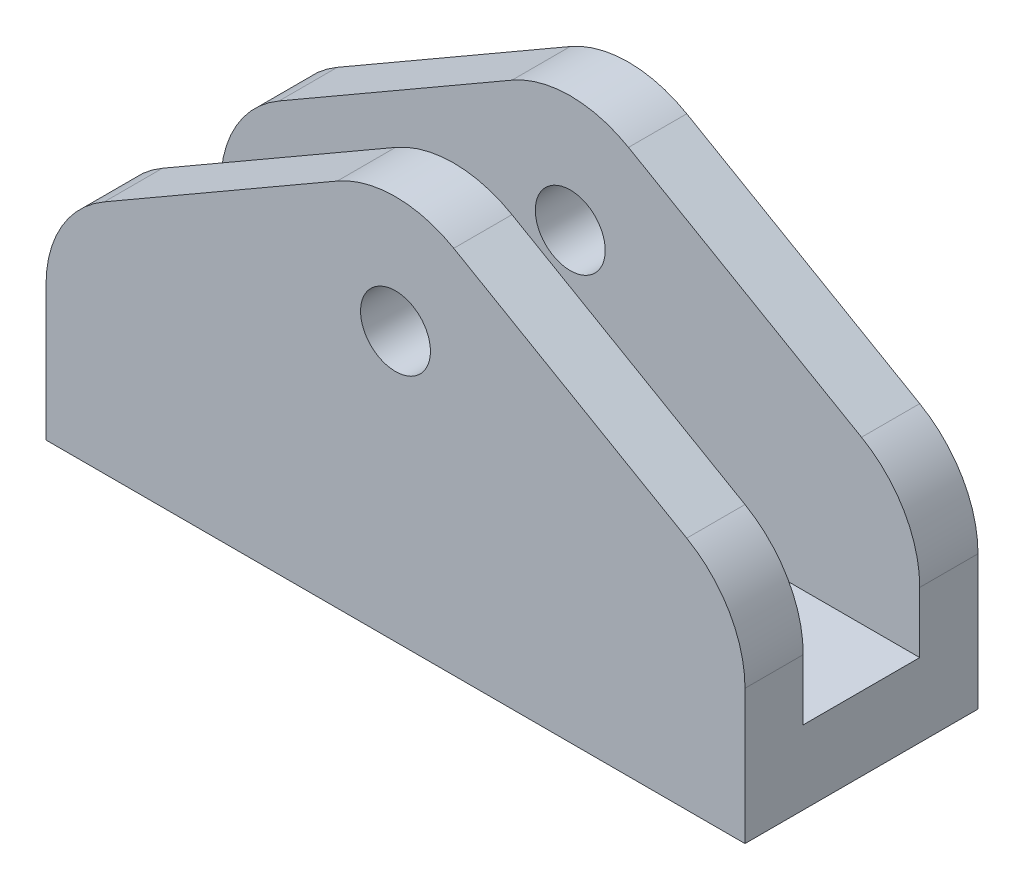
ISO-10303-21;
HEADER;
FILE_DESCRIPTION(('STEP AP214'),'2;1');
FILE_NAME('part.step','',(''),(''),'','','');
FILE_SCHEMA(('AUTOMOTIVE_DESIGN { 1 0 10303 214 1 1 1 1 }'));
ENDSEC;
DATA;
#1=APPLICATION_CONTEXT('core data for automotive mechanical design processes');
#2=APPLICATION_PROTOCOL_DEFINITION('international standard','automotive_design',2000,#1);
#3=PRODUCT_CONTEXT('',#1,'mechanical');
#4=PRODUCT('Part','Part','',(#3));
#5=PRODUCT_RELATED_PRODUCT_CATEGORY('part','',(#4));
#6=PRODUCT_DEFINITION_FORMATION('','',#4);
#7=PRODUCT_DEFINITION_CONTEXT('part definition',#1,'design');
#8=PRODUCT_DEFINITION('design','',#6,#7);
#9=PRODUCT_DEFINITION_SHAPE('','',#8);
#10=(LENGTH_UNIT() NAMED_UNIT(*) SI_UNIT(.MILLI.,.METRE.));
#11=(NAMED_UNIT(*) PLANE_ANGLE_UNIT() SI_UNIT($,.RADIAN.));
#12=(NAMED_UNIT(*) SI_UNIT($,.STERADIAN.) SOLID_ANGLE_UNIT());
#13=UNCERTAINTY_MEASURE_WITH_UNIT(LENGTH_MEASURE(1.E-05),#10,'distance_accuracy_value','');
#14=(GEOMETRIC_REPRESENTATION_CONTEXT(3) GLOBAL_UNCERTAINTY_ASSIGNED_CONTEXT((#13)) GLOBAL_UNIT_ASSIGNED_CONTEXT((#10,
#11,#12)) REPRESENTATION_CONTEXT('',''));
#15=CARTESIAN_POINT('',(0.,0.,0.));
#16=DIRECTION('',(0.,0.,1.));
#17=DIRECTION('',(1.,0.,0.));
#18=AXIS2_PLACEMENT_3D('',#15,#16,#17);
#19=CARTESIAN_POINT('',(14.9999999999999,8.66025403784441,5.));
#20=DIRECTION('',(-0.499999999999995,-0.866025403784442,0.));
#21=DIRECTION('',(0.866025403784442,-0.499999999999995,0.));
#22=AXIS2_PLACEMENT_3D('',#19,#20,#21);
#23=PLANE('',#22);
#24=DIRECTION('',(0.,0.,-1.));
#25=VECTOR('',#24,1.);
#26=CARTESIAN_POINT('',(2.49999999999989,15.8771324027146,5.));
#27=LINE('',#26,#25);
#28=CARTESIAN_POINT('',(2.49999999999989,15.8771324027146,-5.));
#29=VERTEX_POINT('',#28);
#30=CARTESIAN_POINT('',(2.49999999999988,15.8771324027146,-2.5));
#31=VERTEX_POINT('',#30);
#32=EDGE_CURVE('E281',#29,#31,#27,.F.);
#33=ORIENTED_EDGE('',*,*,#32,.T.);
#34=DIRECTION('',(0.866025403784442,-0.499999999999995,0.));
#35=VECTOR('',#34,1.);
#36=CARTESIAN_POINT('',(14.9999999999999,8.66025403784441,-2.5));
#37=LINE('',#36,#35);
#38=CARTESIAN_POINT('',(12.4999999999999,10.1036297108185,-2.5));
#39=VERTEX_POINT('',#38);
#40=EDGE_CURVE('E221',#31,#39,#37,.T.);
#41=ORIENTED_EDGE('',*,*,#40,.T.);
#42=DIRECTION('',(0.,0.,-1.));
#43=VECTOR('',#42,1.);
#44=CARTESIAN_POINT('',(12.4999999999999,10.1036297108185,5.));
#45=LINE('',#44,#43);
#46=CARTESIAN_POINT('',(12.4999999999999,10.1036297108185,-5.));
#47=VERTEX_POINT('',#46);
#48=EDGE_CURVE('E285',#39,#47,#45,.T.);
#49=ORIENTED_EDGE('',*,*,#48,.T.);
#50=DIRECTION('',(-0.866025403784442,0.499999999999995,0.));
#51=VECTOR('',#50,1.);
#52=CARTESIAN_POINT('',(14.9999999999999,8.66025403784441,-5.));
#53=LINE('',#52,#51);
#54=EDGE_CURVE('E271',#47,#29,#53,.T.);
#55=ORIENTED_EDGE('',*,*,#54,.T.);
#56=EDGE_LOOP('',(#33,#41,#49,#55));
#57=FACE_BOUND('',#56,.T.);
#58=ADVANCED_FACE('F39',(#57),#23,.F.);
#59=CARTESIAN_POINT('',(-1.20948461451098E-13,17.3205080756887,5.));
#60=DIRECTION('',(0.500000000000007,-0.866025403784435,0.));
#61=DIRECTION('',(0.866025403784435,0.500000000000007,0.));
#62=AXIS2_PLACEMENT_3D('',#59,#60,#61);
#63=PLANE('',#62);
#64=DIRECTION('',(0.,0.,-1.));
#65=VECTOR('',#64,1.);
#66=CARTESIAN_POINT('',(-12.5,10.1036297108183,5.));
#67=LINE('',#66,#65);
#68=CARTESIAN_POINT('',(-12.5,10.1036297108183,-5.));
#69=VERTEX_POINT('',#68);
#70=CARTESIAN_POINT('',(-12.5,10.1036297108183,-2.5));
#71=VERTEX_POINT('',#70);
#72=EDGE_CURVE('E312',#69,#71,#67,.F.);
#73=ORIENTED_EDGE('',*,*,#72,.T.);
#74=DIRECTION('',(0.866025403784435,0.500000000000007,0.));
#75=VECTOR('',#74,1.);
#76=CARTESIAN_POINT('',(-1.20580097079517E-13,17.3205080756887,-2.5));
#77=LINE('',#76,#75);
#78=CARTESIAN_POINT('',(-2.50000000000012,15.8771324027146,-2.5));
#79=VERTEX_POINT('',#78);
#80=EDGE_CURVE('E214',#71,#79,#77,.T.);
#81=ORIENTED_EDGE('',*,*,#80,.T.);
#82=DIRECTION('',(0.,0.,-1.));
#83=VECTOR('',#82,1.);
#84=CARTESIAN_POINT('',(-2.50000000000012,15.8771324027146,5.));
#85=LINE('',#84,#83);
#86=CARTESIAN_POINT('',(-2.50000000000012,15.8771324027146,-5.));
#87=VERTEX_POINT('',#86);
#88=EDGE_CURVE('E316',#79,#87,#85,.T.);
#89=ORIENTED_EDGE('',*,*,#88,.T.);
#90=DIRECTION('',(-0.866025403784435,-0.500000000000007,0.));
#91=VECTOR('',#90,1.);
#92=CARTESIAN_POINT('',(-1.20948461451098E-13,17.3205080756887,-5.));
#93=LINE('',#92,#91);
#94=EDGE_CURVE('E275',#87,#69,#93,.T.);
#95=ORIENTED_EDGE('',*,*,#94,.T.);
#96=EDGE_LOOP('',(#73,#81,#89,#95));
#97=FACE_BOUND('',#96,.T.);
#98=ADVANCED_FACE('F337',(#97),#63,.F.);
#99=CARTESIAN_POINT('',(9.9999999999999,5.77350269189626,5.));
#100=DIRECTION('',(0.,0.,-1.));
#101=DIRECTION('',(-1.,0.,0.));
#102=AXIS2_PLACEMENT_3D('',#99,#100,#101);
#103=CYLINDRICAL_SURFACE('',#102,5.);
#104=CARTESIAN_POINT('',(9.9999999999999,5.77350269189626,-2.5));
#105=DIRECTION('',(0.,0.,-1.));
#106=DIRECTION('',(0.,1.,0.));
#107=AXIS2_PLACEMENT_3D('',#104,#105,#106);
#108=CIRCLE('',#107,5.);
#109=CARTESIAN_POINT('',(14.9999999999999,5.77350269189626,-2.5));
#110=VERTEX_POINT('',#109);
#111=EDGE_CURVE('E225',#110,#39,#108,.F.);
#112=ORIENTED_EDGE('',*,*,#111,.F.);
#113=DIRECTION('',(0.,0.,-1.));
#114=VECTOR('',#113,1.);
#115=CARTESIAN_POINT('',(14.9999999999999,5.77350269189627,5.));
#116=LINE('',#115,#114);
#117=CARTESIAN_POINT('',(14.9999999999999,5.77350269189627,-5.));
#118=VERTEX_POINT('',#117);
#119=EDGE_CURVE('E300',#118,#110,#116,.F.);
#120=ORIENTED_EDGE('',*,*,#119,.F.);
#121=CARTESIAN_POINT('',(9.9999999999999,5.77350269189626,-5.));
#122=DIRECTION('',(0.,0.,1.));
#123=DIRECTION('',(1.,0.,0.));
#124=AXIS2_PLACEMENT_3D('',#121,#122,#123);
#125=CIRCLE('',#124,5.);
#126=EDGE_CURVE('E296',#47,#118,#125,.F.);
#127=ORIENTED_EDGE('',*,*,#126,.F.);
#128=ORIENTED_EDGE('',*,*,#48,.F.);
#129=EDGE_LOOP('',(#112,#120,#127,#128));
#130=FACE_BOUND('',#129,.T.);
#131=ADVANCED_FACE('F344',(#130),#103,.T.);
#132=CARTESIAN_POINT('',(0.,11.5470053837924,5.));
#133=DIRECTION('',(0.,0.,-1.));
#134=DIRECTION('',(-1.,0.,0.));
#135=AXIS2_PLACEMENT_3D('',#132,#133,#134);
#136=CYLINDRICAL_SURFACE('',#135,5.);
#137=CARTESIAN_POINT('',(0.,11.5470053837924,-2.5));
#138=DIRECTION('',(0.,0.,-1.));
#139=DIRECTION('',(0.,1.,0.));
#140=AXIS2_PLACEMENT_3D('',#137,#138,#139);
#141=CIRCLE('',#140,5.);
#142=EDGE_CURVE('E218',#31,#79,#141,.F.);
#143=ORIENTED_EDGE('',*,*,#142,.F.);
#144=ORIENTED_EDGE('',*,*,#32,.F.);
#145=CARTESIAN_POINT('',(0.,11.5470053837924,-5.));
#146=DIRECTION('',(0.,0.,1.));
#147=DIRECTION('',(1.,0.,0.));
#148=AXIS2_PLACEMENT_3D('',#145,#146,#147);
#149=CIRCLE('',#148,5.);
#150=EDGE_CURVE('E293',#87,#29,#149,.F.);
#151=ORIENTED_EDGE('',*,*,#150,.F.);
#152=ORIENTED_EDGE('',*,*,#88,.F.);
#153=EDGE_LOOP('',(#143,#144,#151,#152));
#154=FACE_BOUND('',#153,.T.);
#155=ADVANCED_FACE('F394',(#154),#136,.T.);
#156=CARTESIAN_POINT('',(-9.99999999999997,5.77350269189612,5.));
#157=DIRECTION('',(0.,0.,-1.));
#158=DIRECTION('',(-1.,0.,0.));
#159=AXIS2_PLACEMENT_3D('',#156,#157,#158);
#160=CYLINDRICAL_SURFACE('',#159,5.);
#161=CARTESIAN_POINT('',(-9.99999999999997,5.77350269189612,-2.5));
#162=DIRECTION('',(0.,0.,-1.));
#163=DIRECTION('',(0.,1.,0.));
#164=AXIS2_PLACEMENT_3D('',#161,#162,#163);
#165=CIRCLE('',#164,5.);
#166=CARTESIAN_POINT('',(-15.,5.77350269189613,-2.5));
#167=VERTEX_POINT('',#166);
#168=EDGE_CURVE('E211',#71,#167,#165,.F.);
#169=ORIENTED_EDGE('',*,*,#168,.F.);
#170=ORIENTED_EDGE('',*,*,#72,.F.);
#171=CARTESIAN_POINT('',(-9.99999999999997,5.77350269189612,-5.));
#172=DIRECTION('',(0.,0.,1.));
#173=DIRECTION('',(1.,0.,0.));
#174=AXIS2_PLACEMENT_3D('',#171,#172,#173);
#175=CIRCLE('',#174,5.);
#176=CARTESIAN_POINT('',(-15.,5.77350269189607,-5.));
#177=VERTEX_POINT('',#176);
#178=EDGE_CURVE('E290',#177,#69,#175,.F.);
#179=ORIENTED_EDGE('',*,*,#178,.F.);
#180=DIRECTION('',(0.,0.,-1.));
#181=VECTOR('',#180,1.);
#182=CARTESIAN_POINT('',(-15.,5.77350269189607,5.));
#183=LINE('',#182,#181);
#184=EDGE_CURVE('E49',#167,#177,#183,.T.);
#185=ORIENTED_EDGE('',*,*,#184,.F.);
#186=EDGE_LOOP('',(#169,#170,#179,#185));
#187=FACE_BOUND('',#186,.T.);
#188=ADVANCED_FACE('F375',(#187),#160,.T.);
#189=CARTESIAN_POINT('',(0.,11.5470053837924,-5.));
#190=DIRECTION('',(0.,0.,1.));
#191=DIRECTION('',(1.,0.,0.));
#192=AXIS2_PLACEMENT_3D('',#189,#190,#191);
#193=CYLINDRICAL_SURFACE('',#192,1.5);
#194=CARTESIAN_POINT('',(0.,11.5470053837924,-2.5));
#195=DIRECTION('',(0.,0.,-1.));
#196=DIRECTION('',(0.,1.,0.));
#197=AXIS2_PLACEMENT_3D('',#194,#195,#196);
#198=CIRCLE('',#197,1.5);
#199=CARTESIAN_POINT('',(0.,13.0470053837924,-2.5));
#200=VERTEX_POINT('',#199);
#201=EDGE_CURVE('E43',#200,#200,#198,.F.);
#202=ORIENTED_EDGE('',*,*,#201,.T.);
#203=EDGE_LOOP('',(#202));
#204=FACE_BOUND('',#203,.T.);
#205=CARTESIAN_POINT('',(0.,11.5470053837924,-5.));
#206=DIRECTION('',(0.,0.,1.));
#207=DIRECTION('',(1.,0.,0.));
#208=AXIS2_PLACEMENT_3D('',#205,#206,#207);
#209=CIRCLE('',#208,1.5);
#210=CARTESIAN_POINT('',(1.49999999999992,11.5470053837924,-5.));
#211=VERTEX_POINT('',#210);
#212=EDGE_CURVE('E229',#211,#211,#209,.T.);
#213=ORIENTED_EDGE('',*,*,#212,.F.);
#214=EDGE_LOOP('',(#213));
#215=FACE_BOUND('',#214,.T.);
#216=ADVANCED_FACE('F357',(#204,#215),#193,.F.);
#217=CARTESIAN_POINT('',(14.9999999999999,-8.66025403784431,5.));
#218=DIRECTION('',(-1.,0.,0.));
#219=DIRECTION('',(0.,-1.,0.));
#220=AXIS2_PLACEMENT_3D('',#217,#218,#219);
#221=PLANE('',#220);
#222=ORIENTED_EDGE('',*,*,#119,.T.);
#223=DIRECTION('',(0.,1.,0.));
#224=VECTOR('',#223,1.);
#225=CARTESIAN_POINT('',(14.9999999999999,29.9290535877455,-2.5));
#226=LINE('',#225,#224);
#227=CARTESIAN_POINT('',(14.9999999999999,3.16495717983936,-2.5));
#228=VERTEX_POINT('',#227);
#229=EDGE_CURVE('E167',#228,#110,#226,.T.);
#230=ORIENTED_EDGE('',*,*,#229,.F.);
#231=DIRECTION('',(0.,0.,-1.));
#232=VECTOR('',#231,1.);
#233=CARTESIAN_POINT('',(14.9999999999999,3.16495717983936,2.5));
#234=LINE('',#233,#232);
#235=CARTESIAN_POINT('',(14.9999999999999,3.16495717983936,2.5));
#236=VERTEX_POINT('',#235);
#237=EDGE_CURVE('E166',#236,#228,#234,.T.);
#238=ORIENTED_EDGE('',*,*,#237,.F.);
#239=DIRECTION('',(0.,-1.,0.));
#240=VECTOR('',#239,1.);
#241=CARTESIAN_POINT('',(14.9999999999999,29.9290535877455,2.5));
#242=LINE('',#241,#240);
#243=CARTESIAN_POINT('',(14.9999999999999,5.77350269189626,2.5));
#244=VERTEX_POINT('',#243);
#245=EDGE_CURVE('E154',#244,#236,#242,.T.);
#246=ORIENTED_EDGE('',*,*,#245,.F.);
#247=CARTESIAN_POINT('',(14.9999999999999,5.77350269189627,5.));
#248=VERTEX_POINT('',#247);
#249=EDGE_CURVE('E299',#244,#248,#116,.F.);
#250=ORIENTED_EDGE('',*,*,#249,.T.);
#251=DIRECTION('',(0.,1.,0.));
#252=VECTOR('',#251,1.);
#253=CARTESIAN_POINT('',(14.9999999999999,-8.66025403784431,5.));
#254=LINE('',#253,#252);
#255=CARTESIAN_POINT('',(14.9999999999999,0.,5.));
#256=VERTEX_POINT('',#255);
#257=EDGE_CURVE('E252',#256,#248,#254,.T.);
#258=ORIENTED_EDGE('',*,*,#257,.F.);
#259=DIRECTION('',(0.,0.,1.));
#260=VECTOR('',#259,1.);
#261=CARTESIAN_POINT('',(14.9999999999999,0.,-5.));
#262=LINE('',#261,#260);
#263=CARTESIAN_POINT('',(14.9999999999999,0.,-5.));
#264=VERTEX_POINT('',#263);
#265=EDGE_CURVE('E241',#264,#256,#262,.T.);
#266=ORIENTED_EDGE('',*,*,#265,.F.);
#267=DIRECTION('',(0.,1.,0.));
#268=VECTOR('',#267,1.);
#269=CARTESIAN_POINT('',(14.9999999999999,-8.66025403784431,-5.));
#270=LINE('',#269,#268);
#271=EDGE_CURVE('E249',#264,#118,#270,.T.);
#272=ORIENTED_EDGE('',*,*,#271,.T.);
#273=EDGE_LOOP('',(#222,#230,#238,#246,#250,#258,#266,#272));
#274=FACE_BOUND('',#273,.T.);
#275=ADVANCED_FACE('F179',(#274),#221,.F.);
#276=CARTESIAN_POINT('',(12.4999999999999,10.1036297108185,5.));
#277=VERTEX_POINT('',#276);
#278=CARTESIAN_POINT('',(12.4999999999999,10.1036297108185,2.5));
#279=VERTEX_POINT('',#278);
#280=EDGE_CURVE('E286',#277,#279,#45,.T.);
#281=ORIENTED_EDGE('',*,*,#280,.T.);
#282=DIRECTION('',(-0.866025403784442,0.499999999999995,0.));
#283=VECTOR('',#282,1.);
#284=CARTESIAN_POINT('',(14.9999999999999,8.66025403784441,2.5));
#285=LINE('',#284,#283);
#286=CARTESIAN_POINT('',(2.49999999999988,15.8771324027146,2.5));
#287=VERTEX_POINT('',#286);
#288=EDGE_CURVE('E205',#279,#287,#285,.T.);
#289=ORIENTED_EDGE('',*,*,#288,.T.);
#290=CARTESIAN_POINT('',(2.49999999999989,15.8771324027146,5.));
#291=VERTEX_POINT('',#290);
#292=EDGE_CURVE('E267',#287,#291,#27,.F.);
#293=ORIENTED_EDGE('',*,*,#292,.T.);
#294=DIRECTION('',(-0.866025403784442,0.499999999999995,0.));
#295=VECTOR('',#294,1.);
#296=CARTESIAN_POINT('',(14.9999999999999,8.66025403784441,5.));
#297=LINE('',#296,#295);
#298=EDGE_CURVE('E256',#277,#291,#297,.T.);
#299=ORIENTED_EDGE('',*,*,#298,.F.);
#300=EDGE_LOOP('',(#281,#289,#293,#299));
#301=FACE_BOUND('',#300,.T.);
#302=ADVANCED_FACE('F340',(#301),#23,.F.);
#303=CARTESIAN_POINT('',(-2.50000000000012,15.8771324027146,5.));
#304=VERTEX_POINT('',#303);
#305=CARTESIAN_POINT('',(-2.50000000000012,15.8771324027146,2.5));
#306=VERTEX_POINT('',#305);
#307=EDGE_CURVE('E317',#304,#306,#85,.T.);
#308=ORIENTED_EDGE('',*,*,#307,.T.);
#309=DIRECTION('',(-0.866025403784435,-0.500000000000007,0.));
#310=VECTOR('',#309,1.);
#311=CARTESIAN_POINT('',(-1.20825673327238E-13,17.3205080756887,2.5));
#312=LINE('',#311,#310);
#313=CARTESIAN_POINT('',(-12.5,10.1036297108183,2.5));
#314=VERTEX_POINT('',#313);
#315=EDGE_CURVE('E198',#306,#314,#312,.T.);
#316=ORIENTED_EDGE('',*,*,#315,.T.);
#317=CARTESIAN_POINT('',(-12.5,10.1036297108183,5.));
#318=VERTEX_POINT('',#317);
#319=EDGE_CURVE('E311',#314,#318,#67,.F.);
#320=ORIENTED_EDGE('',*,*,#319,.T.);
#321=DIRECTION('',(-0.866025403784435,-0.500000000000007,0.));
#322=VECTOR('',#321,1.);
#323=CARTESIAN_POINT('',(-1.20948461451098E-13,17.3205080756887,5.));
#324=LINE('',#323,#322);
#325=EDGE_CURVE('E261',#304,#318,#324,.T.);
#326=ORIENTED_EDGE('',*,*,#325,.F.);
#327=EDGE_LOOP('',(#308,#316,#320,#326));
#328=FACE_BOUND('',#327,.T.);
#329=ADVANCED_FACE('F347',(#328),#63,.F.);
#330=CARTESIAN_POINT('',(-15.,8.6602540378442,5.));
#331=DIRECTION('',(1.,0.,0.));
#332=DIRECTION('',(0.,1.,0.));
#333=AXIS2_PLACEMENT_3D('',#330,#331,#332);
#334=PLANE('',#333);
#335=DIRECTION('',(0.,0.,-1.));
#336=VECTOR('',#335,1.);
#337=CARTESIAN_POINT('',(-15.,3.16495717983936,2.5));
#338=LINE('',#337,#336);
#339=CARTESIAN_POINT('',(-15.,3.16495717983936,2.5));
#340=VERTEX_POINT('',#339);
#341=CARTESIAN_POINT('',(-15.,3.16495717983936,-2.5));
#342=VERTEX_POINT('',#341);
#343=EDGE_CURVE('E174',#340,#342,#338,.T.);
#344=ORIENTED_EDGE('',*,*,#343,.T.);
#345=DIRECTION('',(0.,1.,0.));
#346=VECTOR('',#345,1.);
#347=CARTESIAN_POINT('',(-15.,29.9290535877455,-2.5));
#348=LINE('',#347,#346);
#349=EDGE_CURVE('E181',#342,#167,#348,.T.);
#350=ORIENTED_EDGE('',*,*,#349,.T.);
#351=ORIENTED_EDGE('',*,*,#184,.T.);
#352=DIRECTION('',(0.,-1.,0.));
#353=VECTOR('',#352,1.);
#354=CARTESIAN_POINT('',(-15.,8.6602540378442,-5.));
#355=LINE('',#354,#353);
#356=CARTESIAN_POINT('',(-14.9999999999999,0.,-5.));
#357=VERTEX_POINT('',#356);
#358=EDGE_CURVE('E257',#177,#357,#355,.T.);
#359=ORIENTED_EDGE('',*,*,#358,.T.);
#360=DIRECTION('',(0.,0.,1.));
#361=VECTOR('',#360,1.);
#362=CARTESIAN_POINT('',(-14.9999999999999,-1.56125112837913E-13,-5.));
#363=LINE('',#362,#361);
#364=CARTESIAN_POINT('',(-14.9999999999999,-1.56125112837913E-13,5.));
#365=VERTEX_POINT('',#364);
#366=EDGE_CURVE('E245',#357,#365,#363,.T.);
#367=ORIENTED_EDGE('',*,*,#366,.T.);
#368=DIRECTION('',(0.,-1.,0.));
#369=VECTOR('',#368,1.);
#370=CARTESIAN_POINT('',(-15.,8.6602540378442,5.));
#371=LINE('',#370,#369);
#372=CARTESIAN_POINT('',(-15.,5.77350269189607,5.));
#373=VERTEX_POINT('',#372);
#374=EDGE_CURVE('E264',#373,#365,#371,.T.);
#375=ORIENTED_EDGE('',*,*,#374,.F.);
#376=CARTESIAN_POINT('',(-15.,5.77350269189607,2.5));
#377=VERTEX_POINT('',#376);
#378=EDGE_CURVE('E11',#373,#377,#183,.T.);
#379=ORIENTED_EDGE('',*,*,#378,.T.);
#380=DIRECTION('',(0.,-1.,0.));
#381=VECTOR('',#380,1.);
#382=CARTESIAN_POINT('',(-15.,29.9290535877455,2.5));
#383=LINE('',#382,#381);
#384=EDGE_CURVE('E57',#377,#340,#383,.T.);
#385=ORIENTED_EDGE('',*,*,#384,.T.);
#386=EDGE_LOOP('',(#344,#350,#351,#359,#367,#375,#379,#385));
#387=FACE_BOUND('',#386,.T.);
#388=ADVANCED_FACE('F355',(#387),#334,.F.);
#389=CARTESIAN_POINT('',(0.,0.,5.));
#390=DIRECTION('',(0.,0.,1.));
#391=DIRECTION('',(1.,0.,0.));
#392=AXIS2_PLACEMENT_3D('',#389,#390,#391);
#393=PLANE('',#392);
#394=CARTESIAN_POINT('',(0.,11.5470053837924,5.));
#395=DIRECTION('',(0.,0.,1.));
#396=DIRECTION('',(1.,0.,0.));
#397=AXIS2_PLACEMENT_3D('',#394,#395,#396);
#398=CIRCLE('',#397,1.5);
#399=CARTESIAN_POINT('',(1.49999999999992,11.5470053837924,5.));
#400=VERTEX_POINT('',#399);
#401=EDGE_CURVE('E228',#400,#400,#398,.T.);
#402=ORIENTED_EDGE('',*,*,#401,.F.);
#403=EDGE_LOOP('',(#402));
#404=FACE_BOUND('',#403,.T.);
#405=ORIENTED_EDGE('',*,*,#257,.T.);
#406=CARTESIAN_POINT('',(9.9999999999999,5.77350269189626,5.));
#407=DIRECTION('',(0.,0.,1.));
#408=DIRECTION('',(1.,0.,0.));
#409=AXIS2_PLACEMENT_3D('',#406,#407,#408);
#410=CIRCLE('',#409,5.);
#411=EDGE_CURVE('E308',#248,#277,#410,.T.);
#412=ORIENTED_EDGE('',*,*,#411,.T.);
#413=ORIENTED_EDGE('',*,*,#298,.T.);
#414=CARTESIAN_POINT('',(0.,11.5470053837924,5.));
#415=DIRECTION('',(0.,0.,1.));
#416=DIRECTION('',(1.,0.,0.));
#417=AXIS2_PLACEMENT_3D('',#414,#415,#416);
#418=CIRCLE('',#417,5.);
#419=EDGE_CURVE('E305',#291,#304,#418,.T.);
#420=ORIENTED_EDGE('',*,*,#419,.T.);
#421=ORIENTED_EDGE('',*,*,#325,.T.);
#422=CARTESIAN_POINT('',(-9.99999999999997,5.77350269189612,5.));
#423=DIRECTION('',(0.,0.,1.));
#424=DIRECTION('',(1.,0.,0.));
#425=AXIS2_PLACEMENT_3D('',#422,#423,#424);
#426=CIRCLE('',#425,5.);
#427=EDGE_CURVE('E65',#318,#373,#426,.T.);
#428=ORIENTED_EDGE('',*,*,#427,.T.);
#429=ORIENTED_EDGE('',*,*,#374,.T.);
#430=DIRECTION('',(-1.,0.,0.));
#431=VECTOR('',#430,1.);
#432=CARTESIAN_POINT('',(-14.9999999999999,-1.56125112837913E-13,5.));
#433=LINE('',#432,#431);
#434=EDGE_CURVE('E233',#256,#365,#433,.T.);
#435=ORIENTED_EDGE('',*,*,#434,.F.);
#436=EDGE_LOOP('',(#405,#412,#413,#420,#421,#428,#429,#435));
#437=FACE_BOUND('',#436,.T.);
#438=ADVANCED_FACE('F383',(#404,#437),#393,.T.);
#439=CARTESIAN_POINT('',(0.,0.,-5.));
#440=DIRECTION('',(0.,0.,1.));
#441=DIRECTION('',(1.,0.,0.));
#442=AXIS2_PLACEMENT_3D('',#439,#440,#441);
#443=PLANE('',#442);
#444=ORIENTED_EDGE('',*,*,#212,.T.);
#445=EDGE_LOOP('',(#444));
#446=FACE_BOUND('',#445,.T.);
#447=ORIENTED_EDGE('',*,*,#54,.F.);
#448=ORIENTED_EDGE('',*,*,#126,.T.);
#449=ORIENTED_EDGE('',*,*,#271,.F.);
#450=DIRECTION('',(-1.,0.,0.));
#451=VECTOR('',#450,1.);
#452=CARTESIAN_POINT('',(-14.9999999999999,-1.56125112837913E-13,-5.));
#453=LINE('',#452,#451);
#454=EDGE_CURVE('E237',#264,#357,#453,.T.);
#455=ORIENTED_EDGE('',*,*,#454,.T.);
#456=ORIENTED_EDGE('',*,*,#358,.F.);
#457=ORIENTED_EDGE('',*,*,#178,.T.);
#458=ORIENTED_EDGE('',*,*,#94,.F.);
#459=ORIENTED_EDGE('',*,*,#150,.T.);
#460=EDGE_LOOP('',(#447,#448,#449,#455,#456,#457,#458,#459));
#461=FACE_BOUND('',#460,.T.);
#462=ADVANCED_FACE('F379',(#446,#461),#443,.F.);
#463=CARTESIAN_POINT('',(-14.9999999999999,-1.56125112837913E-13,-5.));
#464=DIRECTION('',(0.,1.,0.));
#465=DIRECTION('',(-1.,0.,0.));
#466=AXIS2_PLACEMENT_3D('',#463,#464,#465);
#467=PLANE('',#466);
#468=ORIENTED_EDGE('',*,*,#434,.T.);
#469=ORIENTED_EDGE('',*,*,#366,.F.);
#470=ORIENTED_EDGE('',*,*,#454,.F.);
#471=ORIENTED_EDGE('',*,*,#265,.T.);
#472=EDGE_LOOP('',(#468,#469,#470,#471));
#473=FACE_BOUND('',#472,.T.);
#474=ADVANCED_FACE('F382',(#473),#467,.F.);
#475=CARTESIAN_POINT('',(9.9999999999999,5.77350269189626,2.5));
#476=DIRECTION('',(0.,0.,1.));
#477=DIRECTION('',(0.,-1.,0.));
#478=AXIS2_PLACEMENT_3D('',#475,#476,#477);
#479=CIRCLE('',#478,5.);
#480=EDGE_CURVE('E161',#279,#244,#479,.F.);
#481=ORIENTED_EDGE('',*,*,#480,.F.);
#482=ORIENTED_EDGE('',*,*,#280,.F.);
#483=ORIENTED_EDGE('',*,*,#411,.F.);
#484=ORIENTED_EDGE('',*,*,#249,.F.);
#485=EDGE_LOOP('',(#481,#482,#483,#484));
#486=FACE_BOUND('',#485,.T.);
#487=ADVANCED_FACE('F363',(#486),#103,.T.);
#488=CARTESIAN_POINT('',(0.,11.5470053837924,2.5));
#489=DIRECTION('',(0.,0.,1.));
#490=DIRECTION('',(0.,-1.,0.));
#491=AXIS2_PLACEMENT_3D('',#488,#489,#490);
#492=CIRCLE('',#491,5.);
#493=EDGE_CURVE('E202',#306,#287,#492,.F.);
#494=ORIENTED_EDGE('',*,*,#493,.F.);
#495=ORIENTED_EDGE('',*,*,#307,.F.);
#496=ORIENTED_EDGE('',*,*,#419,.F.);
#497=ORIENTED_EDGE('',*,*,#292,.F.);
#498=EDGE_LOOP('',(#494,#495,#496,#497));
#499=FACE_BOUND('',#498,.T.);
#500=ADVANCED_FACE('F412',(#499),#136,.T.);
#501=CARTESIAN_POINT('',(-9.99999999999997,5.77350269189612,2.5));
#502=DIRECTION('',(0.,0.,1.));
#503=DIRECTION('',(0.,-1.,0.));
#504=AXIS2_PLACEMENT_3D('',#501,#502,#503);
#505=CIRCLE('',#504,5.);
#506=EDGE_CURVE('E195',#377,#314,#505,.F.);
#507=ORIENTED_EDGE('',*,*,#506,.F.);
#508=ORIENTED_EDGE('',*,*,#378,.F.);
#509=ORIENTED_EDGE('',*,*,#427,.F.);
#510=ORIENTED_EDGE('',*,*,#319,.F.);
#511=EDGE_LOOP('',(#507,#508,#509,#510));
#512=FACE_BOUND('',#511,.T.);
#513=ADVANCED_FACE('F41',(#512),#160,.T.);
#514=CARTESIAN_POINT('',(0.,11.5470053837924,2.5));
#515=DIRECTION('',(0.,0.,1.));
#516=DIRECTION('',(0.,-1.,0.));
#517=AXIS2_PLACEMENT_3D('',#514,#515,#516);
#518=CIRCLE('',#517,1.5);
#519=CARTESIAN_POINT('',(0.,10.0470053837924,2.5));
#520=VERTEX_POINT('',#519);
#521=EDGE_CURVE('E193',#520,#520,#518,.F.);
#522=ORIENTED_EDGE('',*,*,#521,.T.);
#523=EDGE_LOOP('',(#522));
#524=FACE_BOUND('',#523,.T.);
#525=ORIENTED_EDGE('',*,*,#401,.T.);
#526=EDGE_LOOP('',(#525));
#527=FACE_BOUND('',#526,.T.);
#528=ADVANCED_FACE('F324',(#524,#527),#193,.F.);
#529=CARTESIAN_POINT('',(-15.,29.9290535877455,-2.5));
#530=DIRECTION('',(0.,0.,-1.));
#531=DIRECTION('',(0.,1.,0.));
#532=AXIS2_PLACEMENT_3D('',#529,#530,#531);
#533=PLANE('',#532);
#534=ORIENTED_EDGE('',*,*,#111,.T.);
#535=ORIENTED_EDGE('',*,*,#40,.F.);
#536=ORIENTED_EDGE('',*,*,#142,.T.);
#537=ORIENTED_EDGE('',*,*,#80,.F.);
#538=ORIENTED_EDGE('',*,*,#168,.T.);
#539=ORIENTED_EDGE('',*,*,#349,.F.);
#540=DIRECTION('',(1.,0.,0.));
#541=VECTOR('',#540,1.);
#542=CARTESIAN_POINT('',(-15.,3.16495717983936,-2.5));
#543=LINE('',#542,#541);
#544=EDGE_CURVE('E176',#342,#228,#543,.T.);
#545=ORIENTED_EDGE('',*,*,#544,.T.);
#546=ORIENTED_EDGE('',*,*,#229,.T.);
#547=EDGE_LOOP('',(#534,#535,#536,#537,#538,#539,#545,#546));
#548=FACE_BOUND('',#547,.T.);
#549=ORIENTED_EDGE('',*,*,#201,.F.);
#550=EDGE_LOOP('',(#549));
#551=FACE_BOUND('',#550,.T.);
#552=ADVANCED_FACE('F327',(#548,#551),#533,.F.);
#553=CARTESIAN_POINT('',(-15.,29.9290535877455,2.5));
#554=DIRECTION('',(0.,0.,1.));
#555=DIRECTION('',(0.,-1.,0.));
#556=AXIS2_PLACEMENT_3D('',#553,#554,#555);
#557=PLANE('',#556);
#558=ORIENTED_EDGE('',*,*,#480,.T.);
#559=ORIENTED_EDGE('',*,*,#245,.T.);
#560=DIRECTION('',(1.,0.,0.));
#561=VECTOR('',#560,1.);
#562=CARTESIAN_POINT('',(-15.,3.16495717983936,2.5));
#563=LINE('',#562,#561);
#564=EDGE_CURVE('E158',#340,#236,#563,.T.);
#565=ORIENTED_EDGE('',*,*,#564,.F.);
#566=ORIENTED_EDGE('',*,*,#384,.F.);
#567=ORIENTED_EDGE('',*,*,#506,.T.);
#568=ORIENTED_EDGE('',*,*,#315,.F.);
#569=ORIENTED_EDGE('',*,*,#493,.T.);
#570=ORIENTED_EDGE('',*,*,#288,.F.);
#571=EDGE_LOOP('',(#558,#559,#565,#566,#567,#568,#569,#570));
#572=FACE_BOUND('',#571,.T.);
#573=ORIENTED_EDGE('',*,*,#521,.F.);
#574=EDGE_LOOP('',(#573));
#575=FACE_BOUND('',#574,.T.);
#576=ADVANCED_FACE('F156',(#572,#575),#557,.F.);
#577=CARTESIAN_POINT('',(-15.,3.16495717983936,2.5));
#578=DIRECTION('',(0.,-1.,0.));
#579=DIRECTION('',(0.,0.,-1.));
#580=AXIS2_PLACEMENT_3D('',#577,#578,#579);
#581=PLANE('',#580);
#582=ORIENTED_EDGE('',*,*,#544,.F.);
#583=ORIENTED_EDGE('',*,*,#343,.F.);
#584=ORIENTED_EDGE('',*,*,#564,.T.);
#585=ORIENTED_EDGE('',*,*,#237,.T.);
#586=EDGE_LOOP('',(#582,#583,#584,#585));
#587=FACE_BOUND('',#586,.T.);
#588=ADVANCED_FACE('F171',(#587),#581,.F.);
#589=CLOSED_SHELL('',(#58,#98,#131,#155,#188,#216,#275,#302,#329,#388,#438,#462,#474,#487,#500,
#513,#528,#552,#576,#588));
#590=MANIFOLD_SOLID_BREP('B2',#589);
#591=ADVANCED_BREP_SHAPE_REPRESENTATION('',(#18,#590),#14);
#592=SHAPE_DEFINITION_REPRESENTATION(#9,#591);
ENDSEC;
END-ISO-10303-21;
